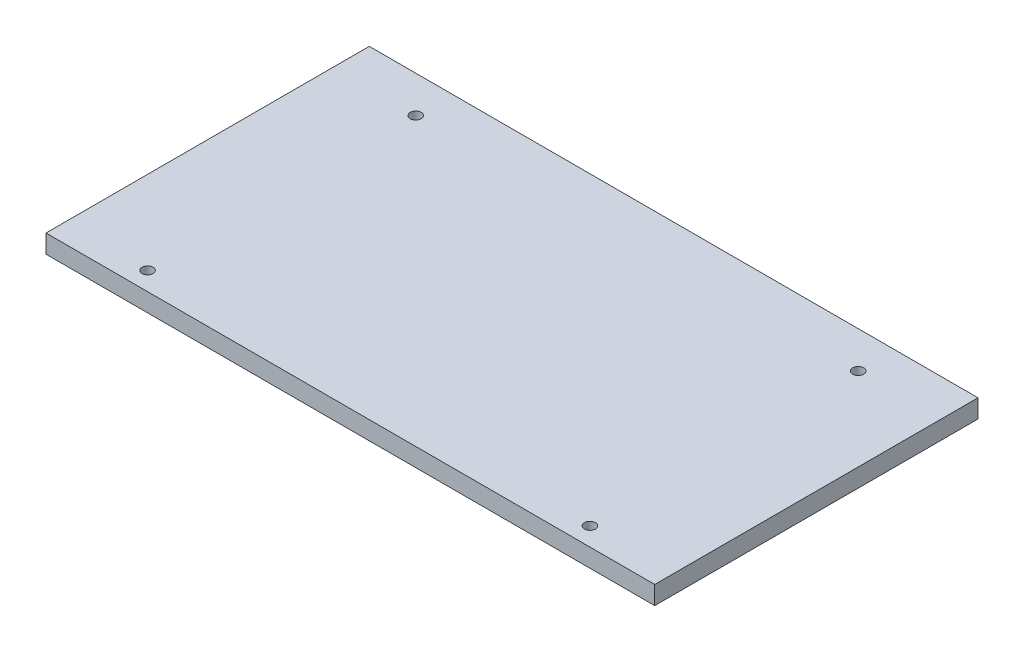
ISO-10303-21;
HEADER;
FILE_DESCRIPTION(('STEP AP214'),'2;1');
FILE_NAME('part.step','',(''),(''),'','','');
FILE_SCHEMA(('AUTOMOTIVE_DESIGN { 1 0 10303 214 1 1 1 1 }'));
ENDSEC;
DATA;
#1=APPLICATION_CONTEXT('core data for automotive mechanical design processes');
#2=APPLICATION_PROTOCOL_DEFINITION('international standard','automotive_design',2000,#1);
#3=PRODUCT_CONTEXT('',#1,'mechanical');
#4=PRODUCT('Part','Part','',(#3));
#5=PRODUCT_RELATED_PRODUCT_CATEGORY('part','',(#4));
#6=PRODUCT_DEFINITION_FORMATION('','',#4);
#7=PRODUCT_DEFINITION_CONTEXT('part definition',#1,'design');
#8=PRODUCT_DEFINITION('design','',#6,#7);
#9=PRODUCT_DEFINITION_SHAPE('','',#8);
#10=(LENGTH_UNIT() NAMED_UNIT(*) SI_UNIT(.MILLI.,.METRE.));
#11=(NAMED_UNIT(*) PLANE_ANGLE_UNIT() SI_UNIT($,.RADIAN.));
#12=(NAMED_UNIT(*) SI_UNIT($,.STERADIAN.) SOLID_ANGLE_UNIT());
#13=UNCERTAINTY_MEASURE_WITH_UNIT(LENGTH_MEASURE(1.E-05),#10,'distance_accuracy_value','');
#14=(GEOMETRIC_REPRESENTATION_CONTEXT(3) GLOBAL_UNCERTAINTY_ASSIGNED_CONTEXT((#13)) GLOBAL_UNIT_ASSIGNED_CONTEXT((#10,
#11,#12)) REPRESENTATION_CONTEXT('',''));
#15=CARTESIAN_POINT('',(0.,0.,0.));
#16=DIRECTION('',(0.,0.,1.));
#17=DIRECTION('',(1.,0.,0.));
#18=AXIS2_PLACEMENT_3D('',#15,#16,#17);
#19=CARTESIAN_POINT('',(0.,5.,-44.));
#20=DIRECTION('',(0.,0.,1.));
#21=DIRECTION('',(1.,0.,0.));
#22=AXIS2_PLACEMENT_3D('',#19,#20,#21);
#23=PLANE('',#22);
#24=DIRECTION('',(-1.,0.,0.));
#25=VECTOR('',#24,1.);
#26=CARTESIAN_POINT('',(0.,0.,-44.));
#27=LINE('',#26,#25);
#28=CARTESIAN_POINT('',(84.023099351517,0.,-44.));
#29=VERTEX_POINT('',#28);
#30=CARTESIAN_POINT('',(-81.6797078460986,0.,-44.));
#31=VERTEX_POINT('',#30);
#32=EDGE_CURVE('E97',#29,#31,#27,.T.);
#33=ORIENTED_EDGE('',*,*,#32,.T.);
#34=DIRECTION('',(0.,1.,0.));
#35=VECTOR('',#34,1.);
#36=CARTESIAN_POINT('',(-81.6797078460986,-88.1419309976812,-44.));
#37=LINE('',#36,#35);
#38=CARTESIAN_POINT('',(-81.6797078460986,5.,-44.));
#39=VERTEX_POINT('',#38);
#40=EDGE_CURVE('E96',#31,#39,#37,.T.);
#41=ORIENTED_EDGE('',*,*,#40,.T.);
#42=DIRECTION('',(-1.,0.,0.));
#43=VECTOR('',#42,1.);
#44=CARTESIAN_POINT('',(0.,5.,-44.));
#45=LINE('',#44,#43);
#46=CARTESIAN_POINT('',(84.023099351517,5.,-44.));
#47=VERTEX_POINT('',#46);
#48=EDGE_CURVE('E81',#47,#39,#45,.T.);
#49=ORIENTED_EDGE('',*,*,#48,.F.);
#50=DIRECTION('',(0.,1.,0.));
#51=VECTOR('',#50,1.);
#52=CARTESIAN_POINT('',(84.023099351517,-88.1419309976812,-44.));
#53=LINE('',#52,#51);
#54=EDGE_CURVE('E117',#29,#47,#53,.T.);
#55=ORIENTED_EDGE('',*,*,#54,.F.);
#56=EDGE_LOOP('',(#33,#41,#49,#55));
#57=FACE_BOUND('',#56,.T.);
#58=ADVANCED_FACE('F41',(#57),#23,.F.);
#59=CARTESIAN_POINT('',(-59.0420655328614,5.,-34.));
#60=DIRECTION('',(0.,-1.,0.));
#61=DIRECTION('',(0.,0.,-1.));
#62=AXIS2_PLACEMENT_3D('',#59,#60,#61);
#63=CYLINDRICAL_SURFACE('',#62,1.5);
#64=CARTESIAN_POINT('',(-59.0420655328614,5.,-34.));
#65=DIRECTION('',(0.,1.,0.));
#66=DIRECTION('',(0.,0.,1.));
#67=AXIS2_PLACEMENT_3D('',#64,#65,#66);
#68=CIRCLE('',#67,1.5);
#69=CARTESIAN_POINT('',(-59.0420655328614,5.,-32.5));
#70=VERTEX_POINT('',#69);
#71=EDGE_CURVE('E51',#70,#70,#68,.T.);
#72=ORIENTED_EDGE('',*,*,#71,.T.);
#73=EDGE_LOOP('',(#72));
#74=FACE_BOUND('',#73,.T.);
#75=CARTESIAN_POINT('',(-59.0420655328614,0.,-34.));
#76=DIRECTION('',(0.,1.,0.));
#77=DIRECTION('',(0.,0.,1.));
#78=AXIS2_PLACEMENT_3D('',#75,#76,#77);
#79=CIRCLE('',#78,1.5);
#80=CARTESIAN_POINT('',(-59.0420655328614,0.,-32.5));
#81=VERTEX_POINT('',#80);
#82=EDGE_CURVE('E149',#81,#81,#79,.T.);
#83=ORIENTED_EDGE('',*,*,#82,.F.);
#84=EDGE_LOOP('',(#83));
#85=FACE_BOUND('',#84,.T.);
#86=ADVANCED_FACE('F175',(#74,#85),#63,.F.);
#87=CARTESIAN_POINT('',(-59.0420655328614,5.,39.));
#88=DIRECTION('',(0.,-1.,0.));
#89=DIRECTION('',(0.,0.,-1.));
#90=AXIS2_PLACEMENT_3D('',#87,#88,#89);
#91=CYLINDRICAL_SURFACE('',#90,1.5);
#92=CARTESIAN_POINT('',(-59.0420655328614,5.,39.));
#93=DIRECTION('',(0.,1.,0.));
#94=DIRECTION('',(0.,0.,1.));
#95=AXIS2_PLACEMENT_3D('',#92,#93,#94);
#96=CIRCLE('',#95,1.5);
#97=CARTESIAN_POINT('',(-59.0420655328614,5.,40.5));
#98=VERTEX_POINT('',#97);
#99=EDGE_CURVE('E131',#98,#98,#96,.T.);
#100=ORIENTED_EDGE('',*,*,#99,.T.);
#101=EDGE_LOOP('',(#100));
#102=FACE_BOUND('',#101,.T.);
#103=CARTESIAN_POINT('',(-59.0420655328614,0.,39.));
#104=DIRECTION('',(0.,1.,0.));
#105=DIRECTION('',(0.,0.,1.));
#106=AXIS2_PLACEMENT_3D('',#103,#104,#105);
#107=CIRCLE('',#106,1.5);
#108=CARTESIAN_POINT('',(-59.0420655328614,0.,40.5));
#109=VERTEX_POINT('',#108);
#110=EDGE_CURVE('E146',#109,#109,#107,.T.);
#111=ORIENTED_EDGE('',*,*,#110,.F.);
#112=EDGE_LOOP('',(#111));
#113=FACE_BOUND('',#112,.T.);
#114=ADVANCED_FACE('F179',(#102,#113),#91,.F.);
#115=CARTESIAN_POINT('',(61.3854570382798,5.,39.));
#116=DIRECTION('',(0.,-1.,0.));
#117=DIRECTION('',(0.,0.,-1.));
#118=AXIS2_PLACEMENT_3D('',#115,#116,#117);
#119=CYLINDRICAL_SURFACE('',#118,1.5);
#120=CARTESIAN_POINT('',(61.3854570382798,5.,39.));
#121=DIRECTION('',(0.,1.,0.));
#122=DIRECTION('',(0.,0.,1.));
#123=AXIS2_PLACEMENT_3D('',#120,#121,#122);
#124=CIRCLE('',#123,1.5);
#125=CARTESIAN_POINT('',(61.3854570382798,5.,40.5));
#126=VERTEX_POINT('',#125);
#127=EDGE_CURVE('E127',#126,#126,#124,.T.);
#128=ORIENTED_EDGE('',*,*,#127,.T.);
#129=EDGE_LOOP('',(#128));
#130=FACE_BOUND('',#129,.T.);
#131=CARTESIAN_POINT('',(61.3854570382798,0.,39.));
#132=DIRECTION('',(0.,1.,0.));
#133=DIRECTION('',(0.,0.,1.));
#134=AXIS2_PLACEMENT_3D('',#131,#132,#133);
#135=CIRCLE('',#134,1.5);
#136=CARTESIAN_POINT('',(61.3854570382798,0.,40.5));
#137=VERTEX_POINT('',#136);
#138=EDGE_CURVE('E142',#137,#137,#135,.T.);
#139=ORIENTED_EDGE('',*,*,#138,.F.);
#140=EDGE_LOOP('',(#139));
#141=FACE_BOUND('',#140,.T.);
#142=ADVANCED_FACE('F172',(#130,#141),#119,.F.);
#143=CARTESIAN_POINT('',(0.,5.,44.));
#144=DIRECTION('',(0.,0.,-1.));
#145=DIRECTION('',(-1.,0.,0.));
#146=AXIS2_PLACEMENT_3D('',#143,#144,#145);
#147=PLANE('',#146);
#148=DIRECTION('',(1.,0.,0.));
#149=VECTOR('',#148,1.);
#150=CARTESIAN_POINT('',(0.,0.,44.));
#151=LINE('',#150,#149);
#152=CARTESIAN_POINT('',(-81.6797078460986,0.,44.));
#153=VERTEX_POINT('',#152);
#154=CARTESIAN_POINT('',(84.023099351517,0.,44.));
#155=VERTEX_POINT('',#154);
#156=EDGE_CURVE('E58',#153,#155,#151,.T.);
#157=ORIENTED_EDGE('',*,*,#156,.T.);
#158=DIRECTION('',(0.,1.,0.));
#159=VECTOR('',#158,1.);
#160=CARTESIAN_POINT('',(84.023099351517,-88.1419309976812,44.));
#161=LINE('',#160,#159);
#162=CARTESIAN_POINT('',(84.023099351517,5.,44.));
#163=VERTEX_POINT('',#162);
#164=EDGE_CURVE('E120',#155,#163,#161,.T.);
#165=ORIENTED_EDGE('',*,*,#164,.T.);
#166=DIRECTION('',(1.,0.,0.));
#167=VECTOR('',#166,1.);
#168=CARTESIAN_POINT('',(0.,5.,44.));
#169=LINE('',#168,#167);
#170=CARTESIAN_POINT('',(-81.6797078460986,5.,44.));
#171=VERTEX_POINT('',#170);
#172=EDGE_CURVE('E93',#171,#163,#169,.T.);
#173=ORIENTED_EDGE('',*,*,#172,.F.);
#174=DIRECTION('',(0.,1.,0.));
#175=VECTOR('',#174,1.);
#176=CARTESIAN_POINT('',(-81.6797078460986,-88.1419309976812,44.));
#177=LINE('',#176,#175);
#178=EDGE_CURVE('E102',#153,#171,#177,.T.);
#179=ORIENTED_EDGE('',*,*,#178,.F.);
#180=EDGE_LOOP('',(#157,#165,#173,#179));
#181=FACE_BOUND('',#180,.T.);
#182=ADVANCED_FACE('F162',(#181),#147,.F.);
#183=CARTESIAN_POINT('',(61.3854570382798,5.,-34.));
#184=DIRECTION('',(0.,-1.,0.));
#185=DIRECTION('',(0.,0.,-1.));
#186=AXIS2_PLACEMENT_3D('',#183,#184,#185);
#187=CYLINDRICAL_SURFACE('',#186,1.5);
#188=CARTESIAN_POINT('',(61.3854570382798,5.,-34.));
#189=DIRECTION('',(0.,1.,0.));
#190=DIRECTION('',(0.,0.,1.));
#191=AXIS2_PLACEMENT_3D('',#188,#189,#190);
#192=CIRCLE('',#191,1.5);
#193=CARTESIAN_POINT('',(61.3854570382798,5.,-32.5));
#194=VERTEX_POINT('',#193);
#195=EDGE_CURVE('E11',#194,#194,#192,.T.);
#196=ORIENTED_EDGE('',*,*,#195,.T.);
#197=EDGE_LOOP('',(#196));
#198=FACE_BOUND('',#197,.T.);
#199=CARTESIAN_POINT('',(61.3854570382798,0.,-34.));
#200=DIRECTION('',(0.,1.,0.));
#201=DIRECTION('',(0.,0.,1.));
#202=AXIS2_PLACEMENT_3D('',#199,#200,#201);
#203=CIRCLE('',#202,1.5);
#204=CARTESIAN_POINT('',(61.3854570382798,0.,-32.5));
#205=VERTEX_POINT('',#204);
#206=EDGE_CURVE('E44',#205,#205,#203,.T.);
#207=ORIENTED_EDGE('',*,*,#206,.F.);
#208=EDGE_LOOP('',(#207));
#209=FACE_BOUND('',#208,.T.);
#210=ADVANCED_FACE('F160',(#198,#209),#187,.F.);
#211=CARTESIAN_POINT('',(0.,5.,0.));
#212=DIRECTION('',(0.,1.,0.));
#213=DIRECTION('',(0.,0.,1.));
#214=AXIS2_PLACEMENT_3D('',#211,#212,#213);
#215=PLANE('',#214);
#216=ORIENTED_EDGE('',*,*,#172,.T.);
#217=DIRECTION('',(0.,0.,-1.));
#218=VECTOR('',#217,1.);
#219=CARTESIAN_POINT('',(84.023099351517,5.,-44.));
#220=LINE('',#219,#218);
#221=EDGE_CURVE('E88',#163,#47,#220,.T.);
#222=ORIENTED_EDGE('',*,*,#221,.T.);
#223=ORIENTED_EDGE('',*,*,#48,.T.);
#224=DIRECTION('',(0.,0.,1.));
#225=VECTOR('',#224,1.);
#226=CARTESIAN_POINT('',(-81.6797078460986,5.,-44.));
#227=LINE('',#226,#225);
#228=EDGE_CURVE('E86',#39,#171,#227,.T.);
#229=ORIENTED_EDGE('',*,*,#228,.T.);
#230=EDGE_LOOP('',(#216,#222,#223,#229));
#231=FACE_BOUND('',#230,.T.);
#232=ORIENTED_EDGE('',*,*,#127,.F.);
#233=EDGE_LOOP('',(#232));
#234=FACE_BOUND('',#233,.T.);
#235=ORIENTED_EDGE('',*,*,#99,.F.);
#236=EDGE_LOOP('',(#235));
#237=FACE_BOUND('',#236,.T.);
#238=ORIENTED_EDGE('',*,*,#71,.F.);
#239=EDGE_LOOP('',(#238));
#240=FACE_BOUND('',#239,.T.);
#241=ORIENTED_EDGE('',*,*,#195,.F.);
#242=EDGE_LOOP('',(#241));
#243=FACE_BOUND('',#242,.T.);
#244=ADVANCED_FACE('F83',(#231,#234,#237,#240,#243),#215,.T.);
#245=CARTESIAN_POINT('',(0.,0.,0.));
#246=DIRECTION('',(0.,1.,0.));
#247=DIRECTION('',(0.,0.,1.));
#248=AXIS2_PLACEMENT_3D('',#245,#246,#247);
#249=PLANE('',#248);
#250=ORIENTED_EDGE('',*,*,#32,.F.);
#251=DIRECTION('',(0.,0.,1.));
#252=VECTOR('',#251,1.);
#253=CARTESIAN_POINT('',(84.023099351517,0.,-44.));
#254=LINE('',#253,#252);
#255=EDGE_CURVE('E114',#29,#155,#254,.T.);
#256=ORIENTED_EDGE('',*,*,#255,.T.);
#257=ORIENTED_EDGE('',*,*,#156,.F.);
#258=DIRECTION('',(0.,0.,-1.));
#259=VECTOR('',#258,1.);
#260=CARTESIAN_POINT('',(-81.6797078460986,0.,-44.));
#261=LINE('',#260,#259);
#262=EDGE_CURVE('E110',#153,#31,#261,.T.);
#263=ORIENTED_EDGE('',*,*,#262,.T.);
#264=EDGE_LOOP('',(#250,#256,#257,#263));
#265=FACE_BOUND('',#264,.T.);
#266=ORIENTED_EDGE('',*,*,#138,.T.);
#267=EDGE_LOOP('',(#266));
#268=FACE_BOUND('',#267,.T.);
#269=ORIENTED_EDGE('',*,*,#110,.T.);
#270=EDGE_LOOP('',(#269));
#271=FACE_BOUND('',#270,.T.);
#272=ORIENTED_EDGE('',*,*,#82,.T.);
#273=EDGE_LOOP('',(#272));
#274=FACE_BOUND('',#273,.T.);
#275=ORIENTED_EDGE('',*,*,#206,.T.);
#276=EDGE_LOOP('',(#275));
#277=FACE_BOUND('',#276,.T.);
#278=ADVANCED_FACE('F158',(#265,#268,#271,#274,#277),#249,.F.);
#279=CARTESIAN_POINT('',(84.023099351517,-88.1419309976812,-44.));
#280=DIRECTION('',(1.,0.,0.));
#281=DIRECTION('',(0.,0.,-1.));
#282=AXIS2_PLACEMENT_3D('',#279,#280,#281);
#283=PLANE('',#282);
#284=ORIENTED_EDGE('',*,*,#255,.F.);
#285=ORIENTED_EDGE('',*,*,#54,.T.);
#286=ORIENTED_EDGE('',*,*,#221,.F.);
#287=ORIENTED_EDGE('',*,*,#164,.F.);
#288=EDGE_LOOP('',(#284,#285,#286,#287));
#289=FACE_BOUND('',#288,.T.);
#290=ADVANCED_FACE('F197',(#289),#283,.T.);
#291=CARTESIAN_POINT('',(-81.6797078460986,-88.1419309976812,-44.));
#292=DIRECTION('',(-1.,0.,0.));
#293=DIRECTION('',(0.,0.,1.));
#294=AXIS2_PLACEMENT_3D('',#291,#292,#293);
#295=PLANE('',#294);
#296=ORIENTED_EDGE('',*,*,#262,.F.);
#297=ORIENTED_EDGE('',*,*,#178,.T.);
#298=ORIENTED_EDGE('',*,*,#228,.F.);
#299=ORIENTED_EDGE('',*,*,#40,.F.);
#300=EDGE_LOOP('',(#296,#297,#298,#299));
#301=FACE_BOUND('',#300,.T.);
#302=ADVANCED_FACE('F105',(#301),#295,.T.);
#303=CLOSED_SHELL('',(#58,#86,#114,#142,#182,#210,#244,#278,#290,#302));
#304=MANIFOLD_SOLID_BREP('B2',#303);
#305=ADVANCED_BREP_SHAPE_REPRESENTATION('',(#18,#304),#14);
#306=SHAPE_DEFINITION_REPRESENTATION(#9,#305);
ENDSEC;
END-ISO-10303-21;
